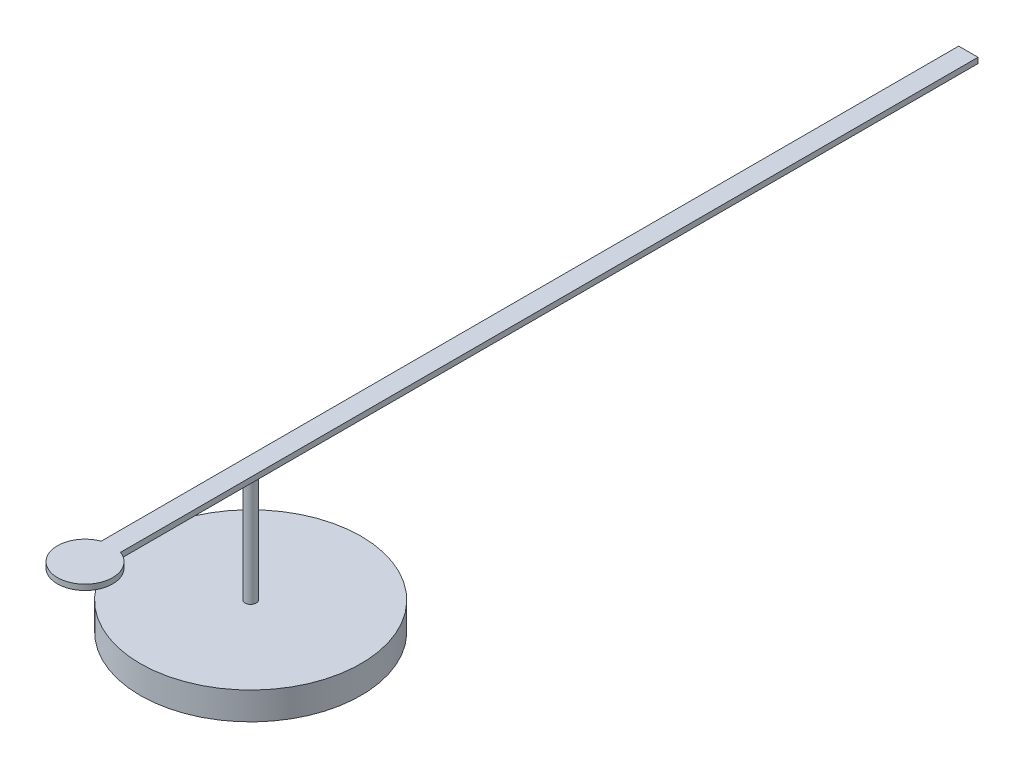
ISO-10303-21;
HEADER;
FILE_DESCRIPTION(('STEP AP214'),'2;1');
FILE_NAME('part.step','',(''),(''),'','','');
FILE_SCHEMA(('AUTOMOTIVE_DESIGN { 1 0 10303 214 1 1 1 1 }'));
ENDSEC;
DATA;
#1=APPLICATION_CONTEXT('core data for automotive mechanical design processes');
#2=APPLICATION_PROTOCOL_DEFINITION('international standard','automotive_design',2000,#1);
#3=PRODUCT_CONTEXT('',#1,'mechanical');
#4=PRODUCT('Part','Part','',(#3));
#5=PRODUCT_RELATED_PRODUCT_CATEGORY('part','',(#4));
#6=PRODUCT_DEFINITION_FORMATION('','',#4);
#7=PRODUCT_DEFINITION_CONTEXT('part definition',#1,'design');
#8=PRODUCT_DEFINITION('design','',#6,#7);
#9=PRODUCT_DEFINITION_SHAPE('','',#8);
#10=(LENGTH_UNIT() NAMED_UNIT(*) SI_UNIT(.MILLI.,.METRE.));
#11=(NAMED_UNIT(*) PLANE_ANGLE_UNIT() SI_UNIT($,.RADIAN.));
#12=(NAMED_UNIT(*) SI_UNIT($,.STERADIAN.) SOLID_ANGLE_UNIT());
#13=UNCERTAINTY_MEASURE_WITH_UNIT(LENGTH_MEASURE(1.E-05),#10,'distance_accuracy_value','');
#14=(GEOMETRIC_REPRESENTATION_CONTEXT(3) GLOBAL_UNCERTAINTY_ASSIGNED_CONTEXT((#13)) GLOBAL_UNIT_ASSIGNED_CONTEXT((#10,
#11,#12)) REPRESENTATION_CONTEXT('',''));
#15=CARTESIAN_POINT('',(0.,0.,0.));
#16=DIRECTION('',(0.,0.,1.));
#17=DIRECTION('',(1.,0.,0.));
#18=AXIS2_PLACEMENT_3D('',#15,#16,#17);
#19=CARTESIAN_POINT('',(0.,0.,3.));
#20=DIRECTION('',(0.,1.,0.));
#21=DIRECTION('',(0.,0.,1.));
#22=AXIS2_PLACEMENT_3D('',#19,#20,#21);
#23=PLANE('',#22);
#24=CARTESIAN_POINT('',(0.,0.,3.));
#25=DIRECTION('',(0.,1.,0.));
#26=DIRECTION('',(0.,0.,1.));
#27=AXIS2_PLACEMENT_3D('',#24,#25,#26);
#28=CIRCLE('',#27,0.5);
#29=CARTESIAN_POINT('',(-0.175,0.,2.53162515012012));
#30=VERTEX_POINT('',#29);
#31=CARTESIAN_POINT('',(0.175,0.,2.53162515012012));
#32=VERTEX_POINT('',#31);
#33=EDGE_CURVE('E118',#30,#32,#28,.T.);
#34=ORIENTED_EDGE('',*,*,#33,.F.);
#35=DIRECTION('',(0.,0.,1.));
#36=VECTOR('',#35,1.);
#37=CARTESIAN_POINT('',(-0.175,0.,2.53162515012012));
#38=LINE('',#37,#36);
#39=CARTESIAN_POINT('',(-0.175,0.,-13.));
#40=VERTEX_POINT('',#39);
#41=EDGE_CURVE('E81',#40,#30,#38,.T.);
#42=ORIENTED_EDGE('',*,*,#41,.F.);
#43=DIRECTION('',(-1.,0.,0.));
#44=VECTOR('',#43,1.);
#45=CARTESIAN_POINT('',(-0.175,0.,-13.));
#46=LINE('',#45,#44);
#47=CARTESIAN_POINT('',(0.175,0.,-13.));
#48=VERTEX_POINT('',#47);
#49=EDGE_CURVE('E125',#48,#40,#46,.T.);
#50=ORIENTED_EDGE('',*,*,#49,.F.);
#51=DIRECTION('',(0.,0.,-1.));
#52=VECTOR('',#51,1.);
#53=CARTESIAN_POINT('',(0.175,0.,-0.46837484987988));
#54=LINE('',#53,#52);
#55=EDGE_CURVE('E107',#32,#48,#54,.T.);
#56=ORIENTED_EDGE('',*,*,#55,.F.);
#57=EDGE_LOOP('',(#34,#42,#50,#56));
#58=FACE_BOUND('',#57,.T.);
#59=CARTESIAN_POINT('',(0.,0.,0.));
#60=DIRECTION('',(0.,1.,0.));
#61=DIRECTION('',(0.,0.,1.));
#62=AXIS2_PLACEMENT_3D('',#59,#60,#61);
#63=CIRCLE('',#62,0.1);
#64=CARTESIAN_POINT('',(0.,0.,0.1));
#65=VERTEX_POINT('',#64);
#66=EDGE_CURVE('E11',#65,#65,#63,.F.);
#67=ORIENTED_EDGE('',*,*,#66,.F.);
#68=EDGE_LOOP('',(#67));
#69=FACE_BOUND('',#68,.T.);
#70=ADVANCED_FACE('F43',(#58,#69),#23,.F.);
#71=CARTESIAN_POINT('',(0.,0.1,3.));
#72=DIRECTION('',(0.,-1.,0.));
#73=DIRECTION('',(0.,0.,-1.));
#74=AXIS2_PLACEMENT_3D('',#71,#72,#73);
#75=CYLINDRICAL_SURFACE('',#74,0.5);
#76=ORIENTED_EDGE('',*,*,#33,.T.);
#77=DIRECTION('',(0.,-1.,0.));
#78=VECTOR('',#77,1.);
#79=CARTESIAN_POINT('',(0.175,0.1,2.53162515012012));
#80=LINE('',#79,#78);
#81=CARTESIAN_POINT('',(0.175,0.1,2.53162515012012));
#82=VERTEX_POINT('',#81);
#83=EDGE_CURVE('E53',#82,#32,#80,.T.);
#84=ORIENTED_EDGE('',*,*,#83,.F.);
#85=CARTESIAN_POINT('',(0.,0.1,3.));
#86=DIRECTION('',(0.,1.,0.));
#87=DIRECTION('',(0.,0.,1.));
#88=AXIS2_PLACEMENT_3D('',#85,#86,#87);
#89=CIRCLE('',#88,0.5);
#90=CARTESIAN_POINT('',(-0.175,0.1,2.53162515012012));
#91=VERTEX_POINT('',#90);
#92=EDGE_CURVE('E100',#91,#82,#89,.T.);
#93=ORIENTED_EDGE('',*,*,#92,.F.);
#94=DIRECTION('',(0.,-1.,0.));
#95=VECTOR('',#94,1.);
#96=CARTESIAN_POINT('',(-0.175,0.1,2.53162515012012));
#97=LINE('',#96,#95);
#98=EDGE_CURVE('E114',#91,#30,#97,.T.);
#99=ORIENTED_EDGE('',*,*,#98,.T.);
#100=EDGE_LOOP('',(#76,#84,#93,#99));
#101=FACE_BOUND('',#100,.T.);
#102=ADVANCED_FACE('F45',(#101),#75,.T.);
#103=CARTESIAN_POINT('',(0.175,0.1,-0.46837484987988));
#104=DIRECTION('',(-1.,0.,0.));
#105=DIRECTION('',(0.,0.,1.));
#106=AXIS2_PLACEMENT_3D('',#103,#104,#105);
#107=PLANE('',#106);
#108=ORIENTED_EDGE('',*,*,#55,.T.);
#109=DIRECTION('',(0.,-1.,0.));
#110=VECTOR('',#109,1.);
#111=CARTESIAN_POINT('',(0.175,0.1,-13.));
#112=LINE('',#111,#110);
#113=CARTESIAN_POINT('',(0.175,0.1,-13.));
#114=VERTEX_POINT('',#113);
#115=EDGE_CURVE('E105',#114,#48,#112,.T.);
#116=ORIENTED_EDGE('',*,*,#115,.F.);
#117=DIRECTION('',(0.,0.,-1.));
#118=VECTOR('',#117,1.);
#119=CARTESIAN_POINT('',(0.175,0.1,2.53162515012012));
#120=LINE('',#119,#118);
#121=EDGE_CURVE('E94',#82,#114,#120,.T.);
#122=ORIENTED_EDGE('',*,*,#121,.F.);
#123=ORIENTED_EDGE('',*,*,#83,.T.);
#124=EDGE_LOOP('',(#108,#116,#122,#123));
#125=FACE_BOUND('',#124,.T.);
#126=ADVANCED_FACE('F106',(#125),#107,.F.);
#127=CARTESIAN_POINT('',(-0.175,0.1,-13.));
#128=DIRECTION('',(0.,0.,1.));
#129=DIRECTION('',(1.,0.,0.));
#130=AXIS2_PLACEMENT_3D('',#127,#128,#129);
#131=PLANE('',#130);
#132=ORIENTED_EDGE('',*,*,#49,.T.);
#133=DIRECTION('',(0.,-1.,0.));
#134=VECTOR('',#133,1.);
#135=CARTESIAN_POINT('',(-0.175,0.1,-13.));
#136=LINE('',#135,#134);
#137=CARTESIAN_POINT('',(-0.175,0.1,-13.));
#138=VERTEX_POINT('',#137);
#139=EDGE_CURVE('E109',#138,#40,#136,.T.);
#140=ORIENTED_EDGE('',*,*,#139,.F.);
#141=DIRECTION('',(-1.,0.,0.));
#142=VECTOR('',#141,1.);
#143=CARTESIAN_POINT('',(-0.175,0.1,-13.));
#144=LINE('',#143,#142);
#145=EDGE_CURVE('E97',#114,#138,#144,.T.);
#146=ORIENTED_EDGE('',*,*,#145,.F.);
#147=ORIENTED_EDGE('',*,*,#115,.T.);
#148=EDGE_LOOP('',(#132,#140,#146,#147));
#149=FACE_BOUND('',#148,.T.);
#150=ADVANCED_FACE('F111',(#149),#131,.F.);
#151=CARTESIAN_POINT('',(-0.175,0.1,2.53162515012012));
#152=DIRECTION('',(1.,0.,0.));
#153=DIRECTION('',(0.,0.,-1.));
#154=AXIS2_PLACEMENT_3D('',#151,#152,#153);
#155=PLANE('',#154);
#156=ORIENTED_EDGE('',*,*,#41,.T.);
#157=ORIENTED_EDGE('',*,*,#98,.F.);
#158=DIRECTION('',(0.,0.,1.));
#159=VECTOR('',#158,1.);
#160=CARTESIAN_POINT('',(-0.175,0.1,-0.46837484987988));
#161=LINE('',#160,#159);
#162=EDGE_CURVE('E64',#138,#91,#161,.T.);
#163=ORIENTED_EDGE('',*,*,#162,.F.);
#164=ORIENTED_EDGE('',*,*,#139,.T.);
#165=EDGE_LOOP('',(#156,#157,#163,#164));
#166=FACE_BOUND('',#165,.T.);
#167=ADVANCED_FACE('F136',(#166),#155,.F.);
#168=CARTESIAN_POINT('',(0.,0.1,3.));
#169=DIRECTION('',(0.,1.,0.));
#170=DIRECTION('',(0.,0.,1.));
#171=AXIS2_PLACEMENT_3D('',#168,#169,#170);
#172=PLANE('',#171);
#173=ORIENTED_EDGE('',*,*,#92,.T.);
#174=ORIENTED_EDGE('',*,*,#121,.T.);
#175=ORIENTED_EDGE('',*,*,#145,.T.);
#176=ORIENTED_EDGE('',*,*,#162,.T.);
#177=EDGE_LOOP('',(#173,#174,#175,#176));
#178=FACE_BOUND('',#177,.T.);
#179=ADVANCED_FACE('F95',(#178),#172,.T.);
#180=CARTESIAN_POINT('',(0.,-2.,0.));
#181=DIRECTION('',(0.,1.,0.));
#182=DIRECTION('',(0.,0.,1.));
#183=AXIS2_PLACEMENT_3D('',#180,#181,#182);
#184=CYLINDRICAL_SURFACE('',#183,0.1);
#185=CARTESIAN_POINT('',(0.,-2.,0.));
#186=DIRECTION('',(0.,-1.,0.));
#187=DIRECTION('',(0.,0.,-1.));
#188=AXIS2_PLACEMENT_3D('',#185,#186,#187);
#189=CIRCLE('',#188,0.1);
#190=CARTESIAN_POINT('',(0.,-2.,-0.1));
#191=VERTEX_POINT('',#190);
#192=EDGE_CURVE('E122',#191,#191,#189,.T.);
#193=ORIENTED_EDGE('',*,*,#192,.F.);
#194=EDGE_LOOP('',(#193));
#195=FACE_BOUND('',#194,.T.);
#196=ORIENTED_EDGE('',*,*,#66,.T.);
#197=EDGE_LOOP('',(#196));
#198=FACE_BOUND('',#197,.T.);
#199=ADVANCED_FACE('F161',(#195,#198),#184,.T.);
#200=CARTESIAN_POINT('',(0.,-2.,0.));
#201=DIRECTION('',(0.,-1.,0.));
#202=DIRECTION('',(0.,0.,-1.));
#203=AXIS2_PLACEMENT_3D('',#200,#201,#202);
#204=PLANE('',#203);
#205=CARTESIAN_POINT('',(0.,-2.,0.));
#206=DIRECTION('',(0.,-1.,0.));
#207=DIRECTION('',(0.,0.,-1.));
#208=AXIS2_PLACEMENT_3D('',#205,#206,#207);
#209=CIRCLE('',#208,2.);
#210=CARTESIAN_POINT('',(0.,-2.,-2.));
#211=VERTEX_POINT('',#210);
#212=EDGE_CURVE('E141',#211,#211,#209,.T.);
#213=ORIENTED_EDGE('',*,*,#212,.F.);
#214=EDGE_LOOP('',(#213));
#215=FACE_BOUND('',#214,.T.);
#216=ORIENTED_EDGE('',*,*,#192,.T.);
#217=EDGE_LOOP('',(#216));
#218=FACE_BOUND('',#217,.T.);
#219=ADVANCED_FACE('F155',(#215,#218),#204,.F.);
#220=CARTESIAN_POINT('',(0.,-2.5,0.));
#221=DIRECTION('',(0.,1.,0.));
#222=DIRECTION('',(0.,0.,1.));
#223=AXIS2_PLACEMENT_3D('',#220,#221,#222);
#224=CYLINDRICAL_SURFACE('',#223,2.);
#225=CARTESIAN_POINT('',(0.,-2.5,0.));
#226=DIRECTION('',(0.,-1.,0.));
#227=DIRECTION('',(0.,0.,-1.));
#228=AXIS2_PLACEMENT_3D('',#225,#226,#227);
#229=CIRCLE('',#228,2.);
#230=CARTESIAN_POINT('',(0.,-2.5,-2.));
#231=VERTEX_POINT('',#230);
#232=EDGE_CURVE('E140',#231,#231,#229,.T.);
#233=ORIENTED_EDGE('',*,*,#232,.F.);
#234=EDGE_LOOP('',(#233));
#235=FACE_BOUND('',#234,.T.);
#236=ORIENTED_EDGE('',*,*,#212,.T.);
#237=EDGE_LOOP('',(#236));
#238=FACE_BOUND('',#237,.T.);
#239=ADVANCED_FACE('F152',(#235,#238),#224,.T.);
#240=CARTESIAN_POINT('',(0.,-2.5,0.));
#241=DIRECTION('',(0.,-1.,0.));
#242=DIRECTION('',(0.,0.,-1.));
#243=AXIS2_PLACEMENT_3D('',#240,#241,#242);
#244=PLANE('',#243);
#245=ORIENTED_EDGE('',*,*,#232,.T.);
#246=EDGE_LOOP('',(#245));
#247=FACE_BOUND('',#246,.T.);
#248=ADVANCED_FACE('F150',(#247),#244,.T.);
#249=CLOSED_SHELL('',(#70,#102,#126,#150,#167,#179,#199,#219,#239,#248));
#250=MANIFOLD_SOLID_BREP('B2',#249);
#251=ADVANCED_BREP_SHAPE_REPRESENTATION('',(#18,#250),#14);
#252=SHAPE_DEFINITION_REPRESENTATION(#9,#251);
ENDSEC;
END-ISO-10303-21;
